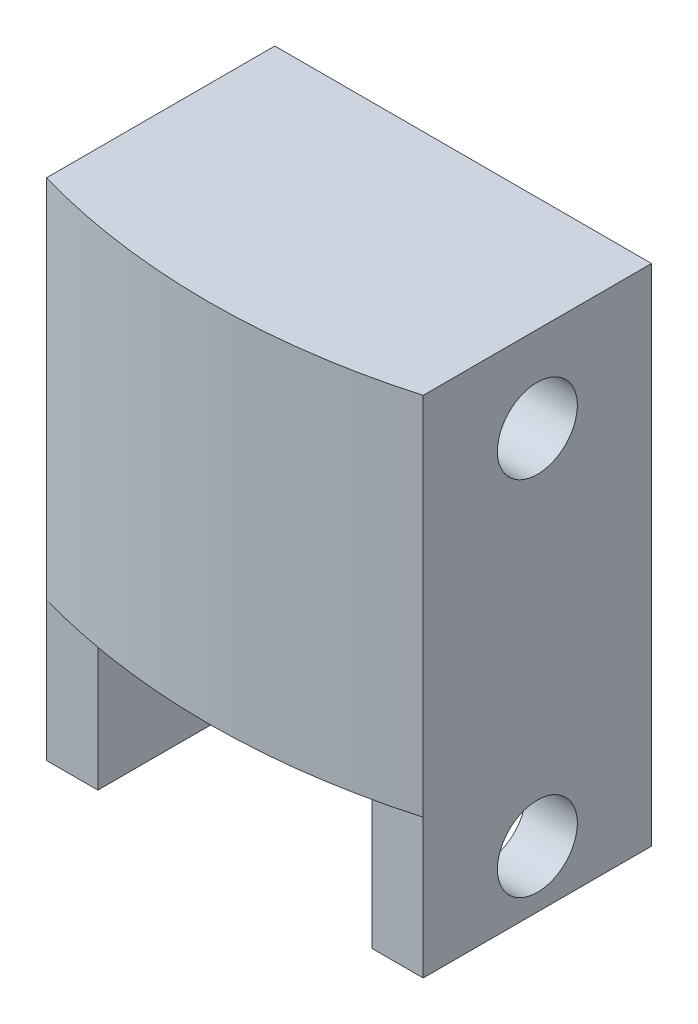
ISO-10303-21;
HEADER;
FILE_DESCRIPTION(('STEP AP214'),'2;1');
FILE_NAME('part.step','',(''),(''),'','','');
FILE_SCHEMA(('AUTOMOTIVE_DESIGN { 1 0 10303 214 1 1 1 1 }'));
ENDSEC;
DATA;
#1=APPLICATION_CONTEXT('core data for automotive mechanical design processes');
#2=APPLICATION_PROTOCOL_DEFINITION('international standard','automotive_design',2000,#1);
#3=PRODUCT_CONTEXT('',#1,'mechanical');
#4=PRODUCT('Part','Part','',(#3));
#5=PRODUCT_RELATED_PRODUCT_CATEGORY('part','',(#4));
#6=PRODUCT_DEFINITION_FORMATION('','',#4);
#7=PRODUCT_DEFINITION_CONTEXT('part definition',#1,'design');
#8=PRODUCT_DEFINITION('design','',#6,#7);
#9=PRODUCT_DEFINITION_SHAPE('','',#8);
#10=(LENGTH_UNIT() NAMED_UNIT(*) SI_UNIT(.MILLI.,.METRE.));
#11=(NAMED_UNIT(*) PLANE_ANGLE_UNIT() SI_UNIT($,.RADIAN.));
#12=(NAMED_UNIT(*) SI_UNIT($,.STERADIAN.) SOLID_ANGLE_UNIT());
#13=UNCERTAINTY_MEASURE_WITH_UNIT(LENGTH_MEASURE(1.E-05),#10,'distance_accuracy_value','');
#14=(GEOMETRIC_REPRESENTATION_CONTEXT(3) GLOBAL_UNCERTAINTY_ASSIGNED_CONTEXT((#13)) GLOBAL_UNIT_ASSIGNED_CONTEXT((#10,
#11,#12)) REPRESENTATION_CONTEXT('',''));
#15=CARTESIAN_POINT('',(0.,0.,0.));
#16=DIRECTION('',(0.,0.,1.));
#17=DIRECTION('',(1.,0.,0.));
#18=AXIS2_PLACEMENT_3D('',#15,#16,#17);
#19=CARTESIAN_POINT('',(16.5,32.,-10.));
#20=DIRECTION('',(1.,0.,0.));
#21=DIRECTION('',(0.,0.,-1.));
#22=AXIS2_PLACEMENT_3D('',#19,#20,#21);
#23=PLANE('',#22);
#24=DIRECTION('',(0.,-1.,0.));
#25=VECTOR('',#24,1.);
#26=CARTESIAN_POINT('',(16.5,32.,10.));
#27=LINE('',#26,#25);
#28=CARTESIAN_POINT('',(16.5,32.,10.));
#29=VERTEX_POINT('',#28);
#30=CARTESIAN_POINT('',(16.5,0.,10.));
#31=VERTEX_POINT('',#30);
#32=EDGE_CURVE('E228',#29,#31,#27,.T.);
#33=ORIENTED_EDGE('',*,*,#32,.T.);
#34=DIRECTION('',(0.,1.,0.));
#35=VECTOR('',#34,1.);
#36=CARTESIAN_POINT('',(16.5,-12.2,9.99999999999999));
#37=LINE('',#36,#35);
#38=CARTESIAN_POINT('',(16.5,-12.2,9.99999999999999));
#39=VERTEX_POINT('',#38);
#40=EDGE_CURVE('E146',#39,#31,#37,.T.);
#41=ORIENTED_EDGE('',*,*,#40,.F.);
#42=DIRECTION('',(0.,0.,1.));
#43=VECTOR('',#42,1.);
#44=CARTESIAN_POINT('',(16.5,-12.2,-10.));
#45=LINE('',#44,#43);
#46=CARTESIAN_POINT('',(16.5,-12.2,-10.));
#47=VERTEX_POINT('',#46);
#48=EDGE_CURVE('E134',#47,#39,#45,.T.);
#49=ORIENTED_EDGE('',*,*,#48,.F.);
#50=DIRECTION('',(0.,-1.,0.));
#51=VECTOR('',#50,1.);
#52=CARTESIAN_POINT('',(16.5,32.,-10.));
#53=LINE('',#52,#51);
#54=CARTESIAN_POINT('',(16.5,32.,-10.));
#55=VERTEX_POINT('',#54);
#56=EDGE_CURVE('E225',#55,#47,#53,.T.);
#57=ORIENTED_EDGE('',*,*,#56,.F.);
#58=DIRECTION('',(0.,0.,1.));
#59=VECTOR('',#58,1.);
#60=CARTESIAN_POINT('',(16.5,32.,-10.));
#61=LINE('',#60,#59);
#62=EDGE_CURVE('E213',#55,#29,#61,.T.);
#63=ORIENTED_EDGE('',*,*,#62,.T.);
#64=EDGE_LOOP('',(#33,#41,#49,#57,#63));
#65=FACE_BOUND('',#64,.T.);
#66=CARTESIAN_POINT('',(16.5,-7.2,0.));
#67=DIRECTION('',(-1.,0.,0.));
#68=DIRECTION('',(0.,0.,1.));
#69=AXIS2_PLACEMENT_3D('',#66,#67,#68);
#70=CIRCLE('',#69,3.5);
#71=CARTESIAN_POINT('',(16.5,-7.2,3.5));
#72=VERTEX_POINT('',#71);
#73=EDGE_CURVE('E169',#72,#72,#70,.T.);
#74=ORIENTED_EDGE('',*,*,#73,.T.);
#75=EDGE_LOOP('',(#74));
#76=FACE_BOUND('',#75,.T.);
#77=CARTESIAN_POINT('',(16.5,24.5,0.));
#78=DIRECTION('',(-1.,0.,0.));
#79=DIRECTION('',(0.,0.,1.));
#80=AXIS2_PLACEMENT_3D('',#77,#78,#79);
#81=CIRCLE('',#80,3.5);
#82=CARTESIAN_POINT('',(16.5,24.5,3.5));
#83=VERTEX_POINT('',#82);
#84=EDGE_CURVE('E279',#83,#83,#81,.T.);
#85=ORIENTED_EDGE('',*,*,#84,.T.);
#86=EDGE_LOOP('',(#85));
#87=FACE_BOUND('',#86,.T.);
#88=ADVANCED_FACE('F38',(#65,#76,#87),#23,.T.);
#89=CARTESIAN_POINT('',(0.,0.,-47.6866535690882));
#90=DIRECTION('',(0.,1.,0.));
#91=DIRECTION('',(0.,0.,1.));
#92=AXIS2_PLACEMENT_3D('',#89,#90,#91);
#93=PLANE('',#92);
#94=DIRECTION('',(1.,0.,0.));
#95=VECTOR('',#94,1.);
#96=CARTESIAN_POINT('',(12.,0.,9.99999999999999));
#97=LINE('',#96,#95);
#98=CARTESIAN_POINT('',(12.,0.,9.99999999999999));
#99=VERTEX_POINT('',#98);
#100=EDGE_CURVE('E128',#99,#31,#97,.T.);
#101=ORIENTED_EDGE('',*,*,#100,.T.);
#102=CARTESIAN_POINT('',(0.,0.,-47.6866535690882));
#103=DIRECTION('',(0.,1.,0.));
#104=DIRECTION('',(0.,0.,1.));
#105=AXIS2_PLACEMENT_3D('',#102,#103,#104);
#106=CIRCLE('',#105,60.);
#107=CARTESIAN_POINT('',(-16.5,0.,9.99999999999999));
#108=VERTEX_POINT('',#107);
#109=EDGE_CURVE('E220',#108,#31,#106,.T.);
#110=ORIENTED_EDGE('',*,*,#109,.F.);
#111=DIRECTION('',(-1.,0.,0.));
#112=VECTOR('',#111,1.);
#113=CARTESIAN_POINT('',(-12.,0.,9.99999999999999));
#114=LINE('',#113,#112);
#115=CARTESIAN_POINT('',(-12.,0.,9.99999999999999));
#116=VERTEX_POINT('',#115);
#117=EDGE_CURVE('E203',#116,#108,#114,.T.);
#118=ORIENTED_EDGE('',*,*,#117,.F.);
#119=DIRECTION('',(0.,0.,-1.));
#120=VECTOR('',#119,1.);
#121=CARTESIAN_POINT('',(-12.,0.,9.99999999999999));
#122=LINE('',#121,#120);
#123=CARTESIAN_POINT('',(-12.,0.,-7.5));
#124=VERTEX_POINT('',#123);
#125=EDGE_CURVE('E158',#116,#124,#122,.T.);
#126=ORIENTED_EDGE('',*,*,#125,.T.);
#127=CARTESIAN_POINT('',(-14.5,0.,-7.5));
#128=DIRECTION('',(0.,1.,0.));
#129=DIRECTION('',(0.,0.,1.));
#130=AXIS2_PLACEMENT_3D('',#127,#128,#129);
#131=CIRCLE('',#130,2.5);
#132=CARTESIAN_POINT('',(-14.5,0.,-10.));
#133=VERTEX_POINT('',#132);
#134=EDGE_CURVE('E46',#124,#133,#131,.T.);
#135=ORIENTED_EDGE('',*,*,#134,.T.);
#136=DIRECTION('',(1.,0.,0.));
#137=VECTOR('',#136,1.);
#138=CARTESIAN_POINT('',(-16.5,0.,-10.));
#139=LINE('',#138,#137);
#140=CARTESIAN_POINT('',(14.5,0.,-10.));
#141=VERTEX_POINT('',#140);
#142=EDGE_CURVE('E163',#133,#141,#139,.T.);
#143=ORIENTED_EDGE('',*,*,#142,.T.);
#144=CARTESIAN_POINT('',(14.5,0.,-7.5));
#145=DIRECTION('',(0.,1.,0.));
#146=DIRECTION('',(0.,0.,1.));
#147=AXIS2_PLACEMENT_3D('',#144,#145,#146);
#148=CIRCLE('',#147,2.5);
#149=CARTESIAN_POINT('',(12.,0.,-7.5));
#150=VERTEX_POINT('',#149);
#151=EDGE_CURVE('E11',#141,#150,#148,.T.);
#152=ORIENTED_EDGE('',*,*,#151,.T.);
#153=DIRECTION('',(0.,0.,-1.));
#154=VECTOR('',#153,1.);
#155=CARTESIAN_POINT('',(12.,0.,9.99999999999999));
#156=LINE('',#155,#154);
#157=EDGE_CURVE('E141',#99,#150,#156,.T.);
#158=ORIENTED_EDGE('',*,*,#157,.F.);
#159=EDGE_LOOP('',(#101,#110,#118,#126,#135,#143,#152,#158));
#160=FACE_BOUND('',#159,.T.);
#161=ADVANCED_FACE('F185',(#160),#93,.F.);
#162=CARTESIAN_POINT('',(-16.5,32.,-10.));
#163=DIRECTION('',(1.,0.,0.));
#164=DIRECTION('',(0.,0.,-1.));
#165=AXIS2_PLACEMENT_3D('',#162,#163,#164);
#166=PLANE('',#165);
#167=CARTESIAN_POINT('',(-16.5,-7.2,0.));
#168=DIRECTION('',(-1.,0.,0.));
#169=DIRECTION('',(0.,0.,1.));
#170=AXIS2_PLACEMENT_3D('',#167,#168,#169);
#171=CIRCLE('',#170,3.5);
#172=CARTESIAN_POINT('',(-16.5,-7.2,3.5));
#173=VERTEX_POINT('',#172);
#174=EDGE_CURVE('E272',#173,#173,#171,.T.);
#175=ORIENTED_EDGE('',*,*,#174,.F.);
#176=EDGE_LOOP('',(#175));
#177=FACE_BOUND('',#176,.T.);
#178=DIRECTION('',(0.,-1.,0.));
#179=VECTOR('',#178,1.);
#180=CARTESIAN_POINT('',(-16.5,32.,-10.));
#181=LINE('',#180,#179);
#182=CARTESIAN_POINT('',(-16.5,32.,-10.));
#183=VERTEX_POINT('',#182);
#184=CARTESIAN_POINT('',(-16.5,-12.2,-10.));
#185=VERTEX_POINT('',#184);
#186=EDGE_CURVE('E219',#183,#185,#181,.T.);
#187=ORIENTED_EDGE('',*,*,#186,.T.);
#188=DIRECTION('',(0.,0.,1.));
#189=VECTOR('',#188,1.);
#190=CARTESIAN_POINT('',(-16.5,-12.2,-10.));
#191=LINE('',#190,#189);
#192=CARTESIAN_POINT('',(-16.5,-12.2,9.99999999999999));
#193=VERTEX_POINT('',#192);
#194=EDGE_CURVE('E150',#185,#193,#191,.T.);
#195=ORIENTED_EDGE('',*,*,#194,.T.);
#196=DIRECTION('',(0.,1.,0.));
#197=VECTOR('',#196,1.);
#198=CARTESIAN_POINT('',(-16.5,-12.2,9.99999999999999));
#199=LINE('',#198,#197);
#200=EDGE_CURVE('E162',#193,#108,#199,.T.);
#201=ORIENTED_EDGE('',*,*,#200,.T.);
#202=DIRECTION('',(0.,-1.,0.));
#203=VECTOR('',#202,1.);
#204=CARTESIAN_POINT('',(-16.5,32.,9.99999999999999));
#205=LINE('',#204,#203);
#206=CARTESIAN_POINT('',(-16.5,32.,9.99999999999999));
#207=VERTEX_POINT('',#206);
#208=EDGE_CURVE('E174',#207,#108,#205,.T.);
#209=ORIENTED_EDGE('',*,*,#208,.F.);
#210=DIRECTION('',(0.,0.,1.));
#211=VECTOR('',#210,1.);
#212=CARTESIAN_POINT('',(-16.5,32.,-10.));
#213=LINE('',#212,#211);
#214=EDGE_CURVE('E208',#183,#207,#213,.T.);
#215=ORIENTED_EDGE('',*,*,#214,.F.);
#216=EDGE_LOOP('',(#187,#195,#201,#209,#215));
#217=FACE_BOUND('',#216,.T.);
#218=ADVANCED_FACE('F239',(#177,#217),#166,.F.);
#219=CARTESIAN_POINT('',(0.,32.,-47.6866535690882));
#220=DIRECTION('',(0.,-1.,0.));
#221=DIRECTION('',(0.,0.,-1.));
#222=AXIS2_PLACEMENT_3D('',#219,#220,#221);
#223=CYLINDRICAL_SURFACE('',#222,60.);
#224=ORIENTED_EDGE('',*,*,#109,.T.);
#225=ORIENTED_EDGE('',*,*,#32,.F.);
#226=CARTESIAN_POINT('',(0.,32.,-47.6866535690882));
#227=DIRECTION('',(0.,1.,0.));
#228=DIRECTION('',(0.,0.,1.));
#229=AXIS2_PLACEMENT_3D('',#226,#227,#228);
#230=CIRCLE('',#229,60.);
#231=EDGE_CURVE('E211',#207,#29,#230,.T.);
#232=ORIENTED_EDGE('',*,*,#231,.F.);
#233=ORIENTED_EDGE('',*,*,#208,.T.);
#234=EDGE_LOOP('',(#224,#225,#232,#233));
#235=FACE_BOUND('',#234,.T.);
#236=ADVANCED_FACE('F233',(#235),#223,.T.);
#237=CARTESIAN_POINT('',(-16.5,32.,-10.));
#238=DIRECTION('',(0.,0.,-1.));
#239=DIRECTION('',(-1.,0.,0.));
#240=AXIS2_PLACEMENT_3D('',#237,#238,#239);
#241=PLANE('',#240);
#242=ORIENTED_EDGE('',*,*,#142,.F.);
#243=DIRECTION('',(0.,-1.,0.));
#244=VECTOR('',#243,1.);
#245=CARTESIAN_POINT('',(-14.5,-12.2,-10.));
#246=LINE('',#245,#244);
#247=CARTESIAN_POINT('',(-14.5,-12.2,-10.));
#248=VERTEX_POINT('',#247);
#249=EDGE_CURVE('E173',#133,#248,#246,.T.);
#250=ORIENTED_EDGE('',*,*,#249,.T.);
#251=DIRECTION('',(-1.,0.,0.));
#252=VECTOR('',#251,1.);
#253=CARTESIAN_POINT('',(-12.,-12.2,-10.));
#254=LINE('',#253,#252);
#255=EDGE_CURVE('E193',#248,#185,#254,.T.);
#256=ORIENTED_EDGE('',*,*,#255,.T.);
#257=ORIENTED_EDGE('',*,*,#186,.F.);
#258=DIRECTION('',(1.,0.,0.));
#259=VECTOR('',#258,1.);
#260=CARTESIAN_POINT('',(-16.5,32.,-10.));
#261=LINE('',#260,#259);
#262=EDGE_CURVE('E216',#183,#55,#261,.T.);
#263=ORIENTED_EDGE('',*,*,#262,.T.);
#264=ORIENTED_EDGE('',*,*,#56,.T.);
#265=DIRECTION('',(1.,0.,0.));
#266=VECTOR('',#265,1.);
#267=CARTESIAN_POINT('',(12.,-12.2,-10.));
#268=LINE('',#267,#266);
#269=CARTESIAN_POINT('',(14.5,-12.2,-10.));
#270=VERTEX_POINT('',#269);
#271=EDGE_CURVE('E138',#270,#47,#268,.T.);
#272=ORIENTED_EDGE('',*,*,#271,.F.);
#273=DIRECTION('',(0.,-1.,0.));
#274=VECTOR('',#273,1.);
#275=CARTESIAN_POINT('',(14.5,0.,-10.));
#276=LINE('',#275,#274);
#277=EDGE_CURVE('E170',#270,#141,#276,.F.);
#278=ORIENTED_EDGE('',*,*,#277,.T.);
#279=EDGE_LOOP('',(#242,#250,#256,#257,#263,#264,#272,#278));
#280=FACE_BOUND('',#279,.T.);
#281=ADVANCED_FACE('F192',(#280),#241,.T.);
#282=CARTESIAN_POINT('',(0.,32.,-47.6866535690882));
#283=DIRECTION('',(0.,1.,0.));
#284=DIRECTION('',(0.,0.,1.));
#285=AXIS2_PLACEMENT_3D('',#282,#283,#284);
#286=PLANE('',#285);
#287=ORIENTED_EDGE('',*,*,#214,.T.);
#288=ORIENTED_EDGE('',*,*,#231,.T.);
#289=ORIENTED_EDGE('',*,*,#62,.F.);
#290=ORIENTED_EDGE('',*,*,#262,.F.);
#291=EDGE_LOOP('',(#287,#288,#289,#290));
#292=FACE_BOUND('',#291,.T.);
#293=ADVANCED_FACE('F249',(#292),#286,.T.);
#294=CARTESIAN_POINT('',(-12.,-12.2,9.99999999999999));
#295=DIRECTION('',(0.,0.,1.));
#296=DIRECTION('',(0.,-1.,0.));
#297=AXIS2_PLACEMENT_3D('',#294,#295,#296);
#298=PLANE('',#297);
#299=ORIENTED_EDGE('',*,*,#200,.F.);
#300=DIRECTION('',(-1.,0.,0.));
#301=VECTOR('',#300,1.);
#302=CARTESIAN_POINT('',(-12.,-12.2,9.99999999999999));
#303=LINE('',#302,#301);
#304=CARTESIAN_POINT('',(-12.,-12.2,9.99999999999999));
#305=VERTEX_POINT('',#304);
#306=EDGE_CURVE('E200',#305,#193,#303,.T.);
#307=ORIENTED_EDGE('',*,*,#306,.F.);
#308=DIRECTION('',(0.,1.,0.));
#309=VECTOR('',#308,1.);
#310=CARTESIAN_POINT('',(-12.,-12.2,9.99999999999999));
#311=LINE('',#310,#309);
#312=EDGE_CURVE('E201',#305,#116,#311,.T.);
#313=ORIENTED_EDGE('',*,*,#312,.T.);
#314=ORIENTED_EDGE('',*,*,#117,.T.);
#315=EDGE_LOOP('',(#299,#307,#313,#314));
#316=FACE_BOUND('',#315,.T.);
#317=ADVANCED_FACE('F311',(#316),#298,.T.);
#318=CARTESIAN_POINT('',(-12.,-12.2,-10.));
#319=DIRECTION('',(0.,-1.,0.));
#320=DIRECTION('',(0.,0.,-1.));
#321=AXIS2_PLACEMENT_3D('',#318,#319,#320);
#322=PLANE('',#321);
#323=ORIENTED_EDGE('',*,*,#255,.F.);
#324=CARTESIAN_POINT('',(-14.5,-12.2,-7.5));
#325=DIRECTION('',(0.,-1.,0.));
#326=DIRECTION('',(0.,0.,-1.));
#327=AXIS2_PLACEMENT_3D('',#324,#325,#326);
#328=CIRCLE('',#327,2.5);
#329=CARTESIAN_POINT('',(-12.,-12.2,-7.5));
#330=VERTEX_POINT('',#329);
#331=EDGE_CURVE('E177',#248,#330,#328,.T.);
#332=ORIENTED_EDGE('',*,*,#331,.T.);
#333=DIRECTION('',(0.,0.,1.));
#334=VECTOR('',#333,1.);
#335=CARTESIAN_POINT('',(-12.,-12.2,-10.));
#336=LINE('',#335,#334);
#337=EDGE_CURVE('E155',#330,#305,#336,.T.);
#338=ORIENTED_EDGE('',*,*,#337,.T.);
#339=ORIENTED_EDGE('',*,*,#306,.T.);
#340=ORIENTED_EDGE('',*,*,#194,.F.);
#341=EDGE_LOOP('',(#323,#332,#338,#339,#340));
#342=FACE_BOUND('',#341,.T.);
#343=ADVANCED_FACE('F197',(#342),#322,.T.);
#344=CARTESIAN_POINT('',(-12.,0.,0.));
#345=DIRECTION('',(-1.,0.,0.));
#346=DIRECTION('',(0.,0.,1.));
#347=AXIS2_PLACEMENT_3D('',#344,#345,#346);
#348=PLANE('',#347);
#349=CARTESIAN_POINT('',(-12.,-7.2,0.));
#350=DIRECTION('',(-1.,0.,0.));
#351=DIRECTION('',(0.,0.,1.));
#352=AXIS2_PLACEMENT_3D('',#349,#350,#351);
#353=CIRCLE('',#352,3.5);
#354=CARTESIAN_POINT('',(-12.,-7.2,3.5));
#355=VERTEX_POINT('',#354);
#356=EDGE_CURVE('E148',#355,#355,#353,.T.);
#357=ORIENTED_EDGE('',*,*,#356,.T.);
#358=EDGE_LOOP('',(#357));
#359=FACE_BOUND('',#358,.T.);
#360=ORIENTED_EDGE('',*,*,#337,.F.);
#361=DIRECTION('',(0.,-1.,0.));
#362=VECTOR('',#361,1.);
#363=CARTESIAN_POINT('',(-12.,0.,-7.5));
#364=LINE('',#363,#362);
#365=EDGE_CURVE('E179',#330,#124,#364,.F.);
#366=ORIENTED_EDGE('',*,*,#365,.T.);
#367=ORIENTED_EDGE('',*,*,#125,.F.);
#368=ORIENTED_EDGE('',*,*,#312,.F.);
#369=EDGE_LOOP('',(#360,#366,#367,#368));
#370=FACE_BOUND('',#369,.T.);
#371=ADVANCED_FACE('F285',(#359,#370),#348,.F.);
#372=CARTESIAN_POINT('',(12.,-12.2,-10.));
#373=DIRECTION('',(0.,1.,0.));
#374=DIRECTION('',(0.,0.,1.));
#375=AXIS2_PLACEMENT_3D('',#372,#373,#374);
#376=PLANE('',#375);
#377=DIRECTION('',(0.,0.,1.));
#378=VECTOR('',#377,1.);
#379=CARTESIAN_POINT('',(12.,-12.2,-10.));
#380=LINE('',#379,#378);
#381=CARTESIAN_POINT('',(12.,-12.2,-7.5));
#382=VERTEX_POINT('',#381);
#383=CARTESIAN_POINT('',(12.,-12.2,9.99999999999999));
#384=VERTEX_POINT('',#383);
#385=EDGE_CURVE('E120',#382,#384,#380,.T.);
#386=ORIENTED_EDGE('',*,*,#385,.F.);
#387=CARTESIAN_POINT('',(14.5,-12.2,-7.5));
#388=DIRECTION('',(0.,1.,0.));
#389=DIRECTION('',(0.,0.,1.));
#390=AXIS2_PLACEMENT_3D('',#387,#388,#389);
#391=CIRCLE('',#390,2.5);
#392=EDGE_CURVE('E53',#382,#270,#391,.F.);
#393=ORIENTED_EDGE('',*,*,#392,.T.);
#394=ORIENTED_EDGE('',*,*,#271,.T.);
#395=ORIENTED_EDGE('',*,*,#48,.T.);
#396=DIRECTION('',(1.,0.,0.));
#397=VECTOR('',#396,1.);
#398=CARTESIAN_POINT('',(12.,-12.2,9.99999999999999));
#399=LINE('',#398,#397);
#400=EDGE_CURVE('E131',#384,#39,#399,.T.);
#401=ORIENTED_EDGE('',*,*,#400,.F.);
#402=EDGE_LOOP('',(#386,#393,#394,#395,#401));
#403=FACE_BOUND('',#402,.T.);
#404=ADVANCED_FACE('F132',(#403),#376,.F.);
#405=CARTESIAN_POINT('',(12.,-12.2,9.99999999999999));
#406=DIRECTION('',(0.,0.,-1.));
#407=DIRECTION('',(0.,1.,0.));
#408=AXIS2_PLACEMENT_3D('',#405,#406,#407);
#409=PLANE('',#408);
#410=ORIENTED_EDGE('',*,*,#40,.T.);
#411=ORIENTED_EDGE('',*,*,#100,.F.);
#412=DIRECTION('',(0.,1.,0.));
#413=VECTOR('',#412,1.);
#414=CARTESIAN_POINT('',(12.,-12.2,9.99999999999999));
#415=LINE('',#414,#413);
#416=EDGE_CURVE('E124',#384,#99,#415,.T.);
#417=ORIENTED_EDGE('',*,*,#416,.F.);
#418=ORIENTED_EDGE('',*,*,#400,.T.);
#419=EDGE_LOOP('',(#410,#411,#417,#418));
#420=FACE_BOUND('',#419,.T.);
#421=ADVANCED_FACE('F140',(#420),#409,.F.);
#422=CARTESIAN_POINT('',(12.,0.,0.));
#423=DIRECTION('',(1.,0.,0.));
#424=DIRECTION('',(0.,0.,1.));
#425=AXIS2_PLACEMENT_3D('',#422,#423,#424);
#426=PLANE('',#425);
#427=CARTESIAN_POINT('',(12.,-7.2,0.));
#428=DIRECTION('',(1.,0.,0.));
#429=DIRECTION('',(0.,0.,-1.));
#430=AXIS2_PLACEMENT_3D('',#427,#428,#429);
#431=CIRCLE('',#430,3.5);
#432=CARTESIAN_POINT('',(12.,-7.2,-3.5));
#433=VERTEX_POINT('',#432);
#434=EDGE_CURVE('E166',#433,#433,#431,.T.);
#435=ORIENTED_EDGE('',*,*,#434,.T.);
#436=EDGE_LOOP('',(#435));
#437=FACE_BOUND('',#436,.T.);
#438=ORIENTED_EDGE('',*,*,#157,.T.);
#439=DIRECTION('',(0.,-1.,0.));
#440=VECTOR('',#439,1.);
#441=CARTESIAN_POINT('',(12.,-12.2,-7.5));
#442=LINE('',#441,#440);
#443=EDGE_CURVE('E126',#150,#382,#442,.T.);
#444=ORIENTED_EDGE('',*,*,#443,.T.);
#445=ORIENTED_EDGE('',*,*,#385,.T.);
#446=ORIENTED_EDGE('',*,*,#416,.T.);
#447=EDGE_LOOP('',(#438,#444,#445,#446));
#448=FACE_BOUND('',#447,.T.);
#449=ADVANCED_FACE('F122',(#437,#448),#426,.F.);
#450=CARTESIAN_POINT('',(16.5,-7.2,0.));
#451=DIRECTION('',(-1.,0.,0.));
#452=DIRECTION('',(0.,0.,1.));
#453=AXIS2_PLACEMENT_3D('',#450,#451,#452);
#454=CYLINDRICAL_SURFACE('',#453,3.5);
#455=ORIENTED_EDGE('',*,*,#73,.F.);
#456=EDGE_LOOP('',(#455));
#457=FACE_BOUND('',#456,.T.);
#458=ORIENTED_EDGE('',*,*,#434,.F.);
#459=EDGE_LOOP('',(#458));
#460=FACE_BOUND('',#459,.T.);
#461=ADVANCED_FACE('F291',(#457,#460),#454,.F.);
#462=ORIENTED_EDGE('',*,*,#174,.T.);
#463=EDGE_LOOP('',(#462));
#464=FACE_BOUND('',#463,.T.);
#465=ORIENTED_EDGE('',*,*,#356,.F.);
#466=EDGE_LOOP('',(#465));
#467=FACE_BOUND('',#466,.T.);
#468=ADVANCED_FACE('F288',(#464,#467),#454,.F.);
#469=CARTESIAN_POINT('',(7.5,24.5,0.));
#470=DIRECTION('',(1.,0.,0.));
#471=DIRECTION('',(0.,0.,-1.));
#472=AXIS2_PLACEMENT_3D('',#469,#470,#471);
#473=CYLINDRICAL_SURFACE('',#472,3.5);
#474=CARTESIAN_POINT('',(7.5,24.5,0.));
#475=DIRECTION('',(-1.,0.,0.));
#476=DIRECTION('',(0.,0.,1.));
#477=AXIS2_PLACEMENT_3D('',#474,#475,#476);
#478=CIRCLE('',#477,3.5);
#479=CARTESIAN_POINT('',(7.5,24.5,3.5));
#480=VERTEX_POINT('',#479);
#481=EDGE_CURVE('E274',#480,#480,#478,.T.);
#482=ORIENTED_EDGE('',*,*,#481,.T.);
#483=EDGE_LOOP('',(#482));
#484=FACE_BOUND('',#483,.T.);
#485=ORIENTED_EDGE('',*,*,#84,.F.);
#486=EDGE_LOOP('',(#485));
#487=FACE_BOUND('',#486,.T.);
#488=ADVANCED_FACE('F290',(#484,#487),#473,.F.);
#489=CARTESIAN_POINT('',(7.5,24.5,0.));
#490=DIRECTION('',(-1.,0.,0.));
#491=DIRECTION('',(0.,0.,1.));
#492=AXIS2_PLACEMENT_3D('',#489,#490,#491);
#493=PLANE('',#492);
#494=ORIENTED_EDGE('',*,*,#481,.F.);
#495=EDGE_LOOP('',(#494));
#496=FACE_BOUND('',#495,.T.);
#497=ADVANCED_FACE('F255',(#496),#493,.F.);
#498=CARTESIAN_POINT('',(-14.5,32.,-7.5));
#499=DIRECTION('',(0.,1.,0.));
#500=DIRECTION('',(0.,0.,1.));
#501=AXIS2_PLACEMENT_3D('',#498,#499,#500);
#502=CYLINDRICAL_SURFACE('',#501,2.5);
#503=ORIENTED_EDGE('',*,*,#134,.F.);
#504=ORIENTED_EDGE('',*,*,#365,.F.);
#505=ORIENTED_EDGE('',*,*,#331,.F.);
#506=ORIENTED_EDGE('',*,*,#249,.F.);
#507=EDGE_LOOP('',(#503,#504,#505,#506));
#508=FACE_BOUND('',#507,.T.);
#509=ADVANCED_FACE('F189',(#508),#502,.T.);
#510=CARTESIAN_POINT('',(14.5,0.,-7.5));
#511=DIRECTION('',(0.,1.,0.));
#512=DIRECTION('',(0.,0.,1.));
#513=AXIS2_PLACEMENT_3D('',#510,#511,#512);
#514=CYLINDRICAL_SURFACE('',#513,2.5);
#515=ORIENTED_EDGE('',*,*,#151,.F.);
#516=ORIENTED_EDGE('',*,*,#277,.F.);
#517=ORIENTED_EDGE('',*,*,#392,.F.);
#518=ORIENTED_EDGE('',*,*,#443,.F.);
#519=EDGE_LOOP('',(#515,#516,#517,#518));
#520=FACE_BOUND('',#519,.T.);
#521=ADVANCED_FACE('F40',(#520),#514,.T.);
#522=CLOSED_SHELL('',(#88,#161,#218,#236,#281,#293,#317,#343,#371,#404,#421,#449,#461,#468,#488,
#497,#509,#521));
#523=MANIFOLD_SOLID_BREP('B2',#522);
#524=ADVANCED_BREP_SHAPE_REPRESENTATION('',(#18,#523),#14);
#525=SHAPE_DEFINITION_REPRESENTATION(#9,#524);
ENDSEC;
END-ISO-10303-21;
